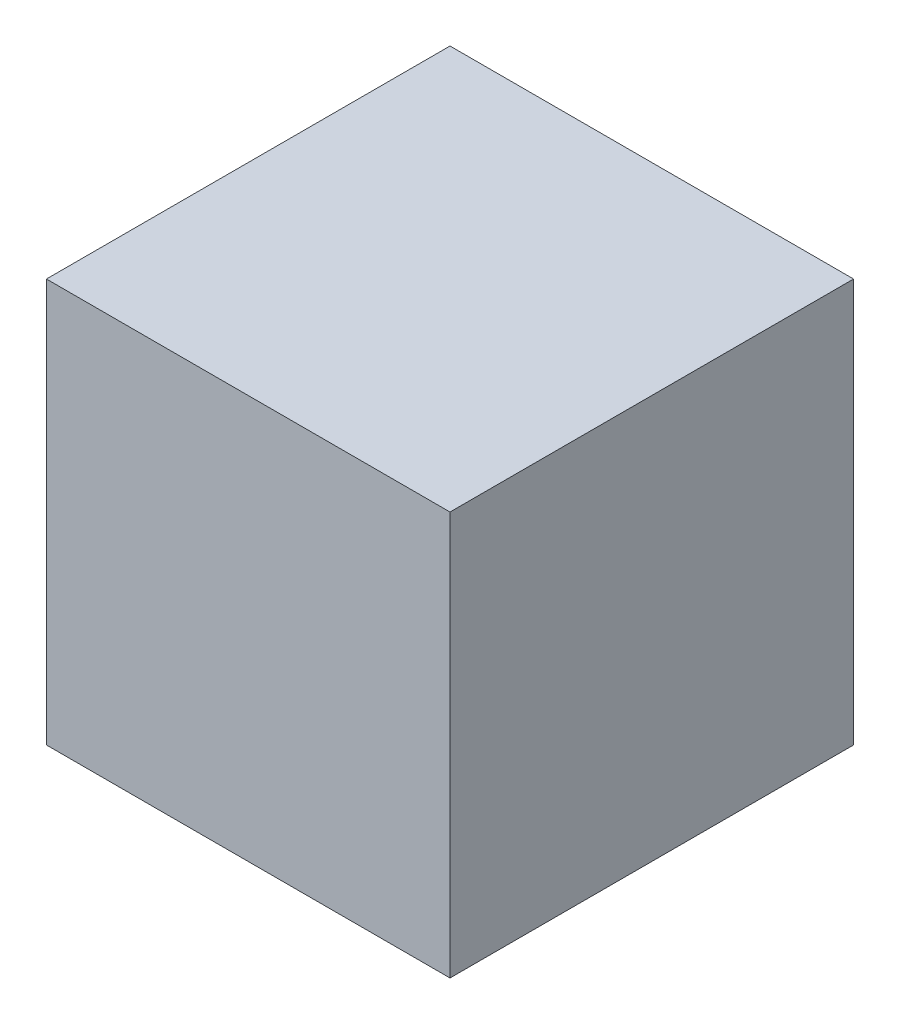
ISO-10303-21;
HEADER;
FILE_DESCRIPTION(('STEP AP214'),'2;1');
FILE_NAME('part.step','',(''),(''),'','','');
FILE_SCHEMA(('AUTOMOTIVE_DESIGN { 1 0 10303 214 1 1 1 1 }'));
ENDSEC;
DATA;
#1=APPLICATION_CONTEXT('core data for automotive mechanical design processes');
#2=APPLICATION_PROTOCOL_DEFINITION('international standard','automotive_design',2000,#1);
#3=PRODUCT_CONTEXT('',#1,'mechanical');
#4=PRODUCT('Part','Part','',(#3));
#5=PRODUCT_RELATED_PRODUCT_CATEGORY('part','',(#4));
#6=PRODUCT_DEFINITION_FORMATION('','',#4);
#7=PRODUCT_DEFINITION_CONTEXT('part definition',#1,'design');
#8=PRODUCT_DEFINITION('design','',#6,#7);
#9=PRODUCT_DEFINITION_SHAPE('','',#8);
#10=(LENGTH_UNIT() NAMED_UNIT(*) SI_UNIT(.MILLI.,.METRE.));
#11=(NAMED_UNIT(*) PLANE_ANGLE_UNIT() SI_UNIT($,.RADIAN.));
#12=(NAMED_UNIT(*) SI_UNIT($,.STERADIAN.) SOLID_ANGLE_UNIT());
#13=UNCERTAINTY_MEASURE_WITH_UNIT(LENGTH_MEASURE(1.E-05),#10,'distance_accuracy_value','');
#14=(GEOMETRIC_REPRESENTATION_CONTEXT(3) GLOBAL_UNCERTAINTY_ASSIGNED_CONTEXT((#13)) GLOBAL_UNIT_ASSIGNED_CONTEXT((#10,
#11,#12)) REPRESENTATION_CONTEXT('',''));
#15=CARTESIAN_POINT('',(0.,0.,0.));
#16=DIRECTION('',(0.,0.,1.));
#17=DIRECTION('',(1.,0.,0.));
#18=AXIS2_PLACEMENT_3D('',#15,#16,#17);
#19=CARTESIAN_POINT('',(0.09999980000001,-0.09999980000001,0.));
#20=DIRECTION('',(-1.,0.,0.));
#21=DIRECTION('',(0.,0.,1.));
#22=AXIS2_PLACEMENT_3D('',#19,#20,#21);
#23=PLANE('',#22);
#24=DIRECTION('',(0.,0.,-1.));
#25=VECTOR('',#24,1.);
#26=CARTESIAN_POINT('',(0.09999980000001,0.09999980000001,0.));
#27=LINE('',#26,#25);
#28=CARTESIAN_POINT('',(0.09999980000001,0.09999980000001,0.));
#29=VERTEX_POINT('',#28);
#30=CARTESIAN_POINT('',(0.09999980000001,0.09999980000001,0.20000214));
#31=VERTEX_POINT('',#30);
#32=EDGE_CURVE('E20',#29,#31,#27,.F.);
#33=ORIENTED_EDGE('',*,*,#32,.T.);
#34=DIRECTION('',(0.,1.,0.));
#35=VECTOR('',#34,1.);
#36=CARTESIAN_POINT('',(0.09999980000001,0.09999980000001,0.20000214));
#37=LINE('',#36,#35);
#38=CARTESIAN_POINT('',(0.09999980000001,-0.09999980000001,0.20000214));
#39=VERTEX_POINT('',#38);
#40=EDGE_CURVE('E55',#31,#39,#37,.F.);
#41=ORIENTED_EDGE('',*,*,#40,.T.);
#42=DIRECTION('',(0.,0.,1.));
#43=VECTOR('',#42,1.);
#44=CARTESIAN_POINT('',(0.09999980000001,-0.09999980000001,0.));
#45=LINE('',#44,#43);
#46=CARTESIAN_POINT('',(0.09999980000001,-0.09999980000001,0.));
#47=VERTEX_POINT('',#46);
#48=EDGE_CURVE('E76',#39,#47,#45,.F.);
#49=ORIENTED_EDGE('',*,*,#48,.T.);
#50=DIRECTION('',(0.,1.,0.));
#51=VECTOR('',#50,1.);
#52=CARTESIAN_POINT('',(0.09999980000001,0.09999980000001,0.));
#53=LINE('',#52,#51);
#54=EDGE_CURVE('E58',#29,#47,#53,.F.);
#55=ORIENTED_EDGE('',*,*,#54,.F.);
#56=EDGE_LOOP('',(#33,#41,#49,#55));
#57=FACE_BOUND('',#56,.T.);
#58=ADVANCED_FACE('F17',(#57),#23,.F.);
#59=CARTESIAN_POINT('',(0.09999980000001,0.09999980000001,0.));
#60=DIRECTION('',(0.,-1.,0.));
#61=DIRECTION('',(0.,0.,-1.));
#62=AXIS2_PLACEMENT_3D('',#59,#60,#61);
#63=PLANE('',#62);
#64=DIRECTION('',(0.,0.,1.));
#65=VECTOR('',#64,1.);
#66=CARTESIAN_POINT('',(-0.09999725999999,0.09999980000001,0.));
#67=LINE('',#66,#65);
#68=CARTESIAN_POINT('',(-0.09999789499999,0.09999980000001,0.));
#69=VERTEX_POINT('',#68);
#70=CARTESIAN_POINT('',(-0.09999789499999,0.09999980000001,0.20000214));
#71=VERTEX_POINT('',#70);
#72=EDGE_CURVE('E73',#69,#71,#67,.T.);
#73=ORIENTED_EDGE('',*,*,#72,.T.);
#74=DIRECTION('',(-1.,0.,0.));
#75=VECTOR('',#74,1.);
#76=CARTESIAN_POINT('',(-0.09999725999999,0.09999980000001,0.20000214));
#77=LINE('',#76,#75);
#78=EDGE_CURVE('E63',#71,#31,#77,.F.);
#79=ORIENTED_EDGE('',*,*,#78,.T.);
#80=ORIENTED_EDGE('',*,*,#32,.F.);
#81=DIRECTION('',(-1.,0.,0.));
#82=VECTOR('',#81,1.);
#83=CARTESIAN_POINT('',(-0.09999725999999,0.09999980000001,0.));
#84=LINE('',#83,#82);
#85=EDGE_CURVE('E78',#69,#29,#84,.F.);
#86=ORIENTED_EDGE('',*,*,#85,.F.);
#87=EDGE_LOOP('',(#73,#79,#80,#86));
#88=FACE_BOUND('',#87,.T.);
#89=ADVANCED_FACE('F72',(#88),#63,.F.);
#90=CARTESIAN_POINT('',(-0.09999725999999,0.09999980000001,0.20000214));
#91=DIRECTION('',(0.,0.,-1.));
#92=DIRECTION('',(-1.,0.,0.));
#93=AXIS2_PLACEMENT_3D('',#90,#91,#92);
#94=PLANE('',#93);
#95=DIRECTION('',(1.,0.,0.));
#96=VECTOR('',#95,1.);
#97=CARTESIAN_POINT('',(-0.09999979999999,-0.09999980000001,0.20000214));
#98=LINE('',#97,#96);
#99=CARTESIAN_POINT('',(-0.0999997999999892,-0.09999980000001,0.20000214));
#100=VERTEX_POINT('',#99);
#101=EDGE_CURVE('E69',#100,#39,#98,.T.);
#102=ORIENTED_EDGE('',*,*,#101,.T.);
#103=ORIENTED_EDGE('',*,*,#40,.F.);
#104=ORIENTED_EDGE('',*,*,#78,.F.);
#105=DIRECTION('',(1.27000253840145E-05,0.999999999919355,0.));
#106=VECTOR('',#105,1.);
#107=CARTESIAN_POINT('',(-0.09999725999999,0.09999980000001,0.20000214));
#108=LINE('',#107,#106);
#109=EDGE_CURVE('E83',#71,#100,#108,.F.);
#110=ORIENTED_EDGE('',*,*,#109,.T.);
#111=EDGE_LOOP('',(#102,#103,#104,#110));
#112=FACE_BOUND('',#111,.T.);
#113=ADVANCED_FACE('F66',(#112),#94,.F.);
#114=CARTESIAN_POINT('',(-0.09999979999999,-0.09999980000001,0.));
#115=DIRECTION('',(0.,1.,0.));
#116=DIRECTION('',(0.,0.,1.));
#117=AXIS2_PLACEMENT_3D('',#114,#115,#116);
#118=PLANE('',#117);
#119=ORIENTED_EDGE('',*,*,#48,.F.);
#120=ORIENTED_EDGE('',*,*,#101,.F.);
#121=DIRECTION('',(0.,0.,1.));
#122=VECTOR('',#121,1.);
#123=CARTESIAN_POINT('',(-0.099999799999987,-0.09999980000001,0.));
#124=LINE('',#123,#122);
#125=CARTESIAN_POINT('',(-0.0999997999999892,-0.09999980000001,0.));
#126=VERTEX_POINT('',#125);
#127=EDGE_CURVE('E26',#100,#126,#124,.F.);
#128=ORIENTED_EDGE('',*,*,#127,.T.);
#129=DIRECTION('',(-1.,0.,0.));
#130=VECTOR('',#129,1.);
#131=CARTESIAN_POINT('',(-0.09999725999999,-0.09999980000001,0.));
#132=LINE('',#131,#130);
#133=EDGE_CURVE('E34',#47,#126,#132,.T.);
#134=ORIENTED_EDGE('',*,*,#133,.F.);
#135=EDGE_LOOP('',(#119,#120,#128,#134));
#136=FACE_BOUND('',#135,.T.);
#137=ADVANCED_FACE('F88',(#136),#118,.F.);
#138=CARTESIAN_POINT('',(-0.09999725999999,0.09999980000001,0.));
#139=DIRECTION('',(0.,0.,-1.));
#140=DIRECTION('',(-1.,0.,0.));
#141=AXIS2_PLACEMENT_3D('',#138,#139,#140);
#142=PLANE('',#141);
#143=ORIENTED_EDGE('',*,*,#133,.T.);
#144=DIRECTION('',(1.27000253840145E-05,0.999999999919355,0.));
#145=VECTOR('',#144,1.);
#146=CARTESIAN_POINT('',(-0.09999725999999,0.09999980000001,0.));
#147=LINE('',#146,#145);
#148=EDGE_CURVE('E11',#126,#69,#147,.T.);
#149=ORIENTED_EDGE('',*,*,#148,.T.);
#150=ORIENTED_EDGE('',*,*,#85,.T.);
#151=ORIENTED_EDGE('',*,*,#54,.T.);
#152=EDGE_LOOP('',(#143,#149,#150,#151));
#153=FACE_BOUND('',#152,.T.);
#154=ADVANCED_FACE('F91',(#153),#142,.T.);
#155=CARTESIAN_POINT('',(-0.09999725999999,0.09999980000001,0.));
#156=DIRECTION('',(0.999999999919355,-1.27000253840145E-05,0.));
#157=DIRECTION('',(1.27000253840145E-05,0.999999999919355,0.));
#158=AXIS2_PLACEMENT_3D('',#155,#156,#157);
#159=PLANE('',#158);
#160=ORIENTED_EDGE('',*,*,#127,.F.);
#161=ORIENTED_EDGE('',*,*,#109,.F.);
#162=ORIENTED_EDGE('',*,*,#72,.F.);
#163=ORIENTED_EDGE('',*,*,#148,.F.);
#164=EDGE_LOOP('',(#160,#161,#162,#163));
#165=FACE_BOUND('',#164,.T.);
#166=ADVANCED_FACE('F90',(#165),#159,.F.);
#167=CLOSED_SHELL('',(#58,#89,#113,#137,#154,#166));
#168=MANIFOLD_SOLID_BREP('B1',#167);
#169=ADVANCED_BREP_SHAPE_REPRESENTATION('',(#18,#168),#14);
#170=SHAPE_DEFINITION_REPRESENTATION(#9,#169);
ENDSEC;
END-ISO-10303-21;
